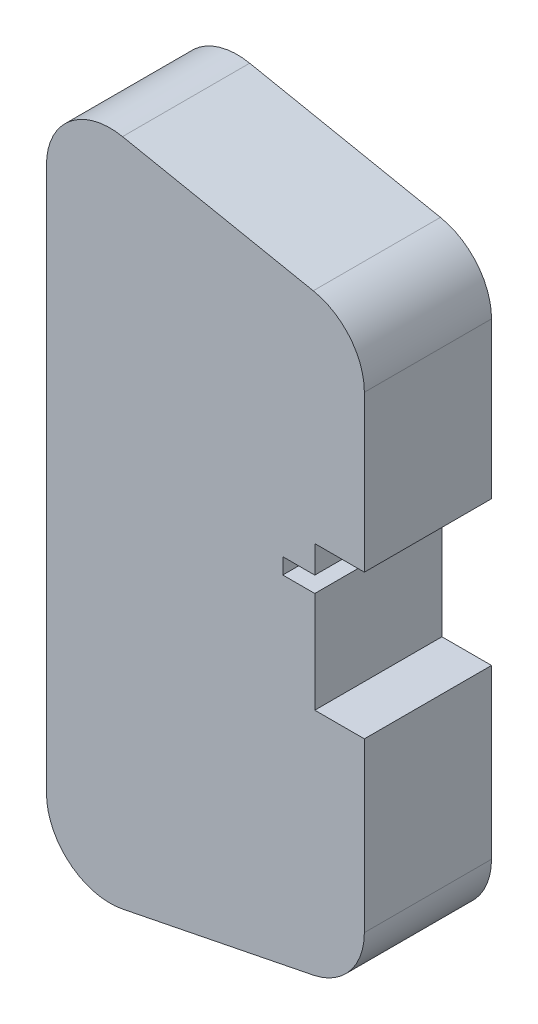
ISO-10303-21;
HEADER;
FILE_DESCRIPTION(('STEP AP214'),'2;1');
FILE_NAME('part.step','',(''),(''),'','','');
FILE_SCHEMA(('AUTOMOTIVE_DESIGN { 1 0 10303 214 1 1 1 1 }'));
ENDSEC;
DATA;
#1=APPLICATION_CONTEXT('core data for automotive mechanical design processes');
#2=APPLICATION_PROTOCOL_DEFINITION('international standard','automotive_design',2000,#1);
#3=PRODUCT_CONTEXT('',#1,'mechanical');
#4=PRODUCT('Part','Part','',(#3));
#5=PRODUCT_RELATED_PRODUCT_CATEGORY('part','',(#4));
#6=PRODUCT_DEFINITION_FORMATION('','',#4);
#7=PRODUCT_DEFINITION_CONTEXT('part definition',#1,'design');
#8=PRODUCT_DEFINITION('design','',#6,#7);
#9=PRODUCT_DEFINITION_SHAPE('','',#8);
#10=(LENGTH_UNIT() NAMED_UNIT(*) SI_UNIT(.MILLI.,.METRE.));
#11=(NAMED_UNIT(*) PLANE_ANGLE_UNIT() SI_UNIT($,.RADIAN.));
#12=(NAMED_UNIT(*) SI_UNIT($,.STERADIAN.) SOLID_ANGLE_UNIT());
#13=UNCERTAINTY_MEASURE_WITH_UNIT(LENGTH_MEASURE(1.E-05),#10,'distance_accuracy_value','');
#14=(GEOMETRIC_REPRESENTATION_CONTEXT(3) GLOBAL_UNCERTAINTY_ASSIGNED_CONTEXT((#13)) GLOBAL_UNIT_ASSIGNED_CONTEXT((#10,
#11,#12)) REPRESENTATION_CONTEXT('',''));
#15=CARTESIAN_POINT('',(0.,0.,0.));
#16=DIRECTION('',(0.,0.,1.));
#17=DIRECTION('',(1.,0.,0.));
#18=AXIS2_PLACEMENT_3D('',#15,#16,#17);
#19=CARTESIAN_POINT('',(50.,-36.8019609728144,20.));
#20=DIRECTION('',(-1.,0.,0.));
#21=DIRECTION('',(0.,0.,1.));
#22=AXIS2_PLACEMENT_3D('',#19,#20,#21);
#23=PLANE('',#22);
#24=DIRECTION('',(0.,1.,0.));
#25=VECTOR('',#24,1.);
#26=CARTESIAN_POINT('',(50.,-36.8019609728144,0.));
#27=LINE('',#26,#25);
#28=CARTESIAN_POINT('',(50.,-36.8019609728144,0.));
#29=VERTEX_POINT('',#28);
#30=CARTESIAN_POINT('',(50.,-10.4028915543573,0.));
#31=VERTEX_POINT('',#30);
#32=EDGE_CURVE('E193',#29,#31,#27,.T.);
#33=ORIENTED_EDGE('',*,*,#32,.T.);
#34=DIRECTION('',(0.,0.,1.));
#35=VECTOR('',#34,1.);
#36=CARTESIAN_POINT('',(50.,-10.4028915543573,0.));
#37=LINE('',#36,#35);
#38=CARTESIAN_POINT('',(50.,-10.4028915543573,20.));
#39=VERTEX_POINT('',#38);
#40=EDGE_CURVE('E242',#31,#39,#37,.T.);
#41=ORIENTED_EDGE('',*,*,#40,.T.);
#42=DIRECTION('',(0.,1.,0.));
#43=VECTOR('',#42,1.);
#44=CARTESIAN_POINT('',(50.,-36.8019609728144,20.));
#45=LINE('',#44,#43);
#46=CARTESIAN_POINT('',(50.,-36.8019609728144,20.));
#47=VERTEX_POINT('',#46);
#48=EDGE_CURVE('E244',#47,#39,#45,.T.);
#49=ORIENTED_EDGE('',*,*,#48,.F.);
#50=DIRECTION('',(0.,0.,-1.));
#51=VECTOR('',#50,1.);
#52=CARTESIAN_POINT('',(50.,-36.8019609728144,20.));
#53=LINE('',#52,#51);
#54=EDGE_CURVE('E224',#47,#29,#53,.T.);
#55=ORIENTED_EDGE('',*,*,#54,.T.);
#56=EDGE_LOOP('',(#33,#41,#49,#55));
#57=FACE_BOUND('',#56,.T.);
#58=ADVANCED_FACE('F32',(#57),#23,.F.);
#59=CARTESIAN_POINT('',(10.,-42.8019609728144,20.));
#60=DIRECTION('',(0.,0.,-1.));
#61=DIRECTION('',(-1.,0.,0.));
#62=AXIS2_PLACEMENT_3D('',#59,#60,#61);
#63=CYLINDRICAL_SURFACE('',#62,10.);
#64=CARTESIAN_POINT('',(10.,-42.8019609728144,0.));
#65=DIRECTION('',(0.,0.,1.));
#66=DIRECTION('',(1.,0.,0.));
#67=AXIS2_PLACEMENT_3D('',#64,#65,#66);
#68=CIRCLE('',#67,10.);
#69=CARTESIAN_POINT('',(0.,-42.8019609728144,0.));
#70=VERTEX_POINT('',#69);
#71=CARTESIAN_POINT('',(11.9611613513819,-52.6077677297236,0.));
#72=VERTEX_POINT('',#71);
#73=EDGE_CURVE('E258',#70,#72,#68,.T.);
#74=ORIENTED_EDGE('',*,*,#73,.T.);
#75=DIRECTION('',(0.,0.,-1.));
#76=VECTOR('',#75,1.);
#77=CARTESIAN_POINT('',(11.9611613513819,-52.6077677297236,20.));
#78=LINE('',#77,#76);
#79=CARTESIAN_POINT('',(11.9611613513819,-52.6077677297236,20.));
#80=VERTEX_POINT('',#79);
#81=EDGE_CURVE('E11',#80,#72,#78,.T.);
#82=ORIENTED_EDGE('',*,*,#81,.F.);
#83=CARTESIAN_POINT('',(10.,-42.8019609728144,20.));
#84=DIRECTION('',(0.,0.,1.));
#85=DIRECTION('',(1.,0.,0.));
#86=AXIS2_PLACEMENT_3D('',#83,#84,#85);
#87=CIRCLE('',#86,10.);
#88=CARTESIAN_POINT('',(0.,-42.8019609728144,20.));
#89=VERTEX_POINT('',#88);
#90=EDGE_CURVE('E208',#89,#80,#87,.T.);
#91=ORIENTED_EDGE('',*,*,#90,.F.);
#92=DIRECTION('',(0.,0.,-1.));
#93=VECTOR('',#92,1.);
#94=CARTESIAN_POINT('',(0.,-42.8019609728144,20.));
#95=LINE('',#94,#93);
#96=EDGE_CURVE('E209',#89,#70,#95,.T.);
#97=ORIENTED_EDGE('',*,*,#96,.T.);
#98=EDGE_LOOP('',(#74,#82,#91,#97));
#99=FACE_BOUND('',#98,.T.);
#100=ADVANCED_FACE('F34',(#99),#63,.T.);
#101=CARTESIAN_POINT('',(41.9611613513819,-46.6077677297236,20.));
#102=DIRECTION('',(-0.196116135138184,0.98058067569092,0.));
#103=DIRECTION('',(-0.98058067569092,-0.196116135138184,0.));
#104=AXIS2_PLACEMENT_3D('',#101,#102,#103);
#105=PLANE('',#104);
#106=DIRECTION('',(0.98058067569092,0.196116135138184,0.));
#107=VECTOR('',#106,1.);
#108=CARTESIAN_POINT('',(41.9611613513819,-46.6077677297236,0.));
#109=LINE('',#108,#107);
#110=CARTESIAN_POINT('',(41.9611613513818,-46.6077677297236,0.));
#111=VERTEX_POINT('',#110);
#112=EDGE_CURVE('E197',#72,#111,#109,.T.);
#113=ORIENTED_EDGE('',*,*,#112,.T.);
#114=DIRECTION('',(0.,0.,-1.));
#115=VECTOR('',#114,1.);
#116=CARTESIAN_POINT('',(41.9611613513818,-46.6077677297236,20.));
#117=LINE('',#116,#115);
#118=CARTESIAN_POINT('',(41.9611613513818,-46.6077677297236,20.));
#119=VERTEX_POINT('',#118);
#120=EDGE_CURVE('E40',#119,#111,#117,.T.);
#121=ORIENTED_EDGE('',*,*,#120,.F.);
#122=DIRECTION('',(0.98058067569092,0.196116135138184,0.));
#123=VECTOR('',#122,1.);
#124=CARTESIAN_POINT('',(41.9611613513819,-46.6077677297236,20.));
#125=LINE('',#124,#123);
#126=EDGE_CURVE('E263',#80,#119,#125,.T.);
#127=ORIENTED_EDGE('',*,*,#126,.F.);
#128=ORIENTED_EDGE('',*,*,#81,.T.);
#129=EDGE_LOOP('',(#113,#121,#127,#128));
#130=FACE_BOUND('',#129,.T.);
#131=ADVANCED_FACE('F261',(#130),#105,.F.);
#132=CARTESIAN_POINT('',(40.,-36.8019609728144,20.));
#133=DIRECTION('',(0.,0.,-1.));
#134=DIRECTION('',(-1.,0.,0.));
#135=AXIS2_PLACEMENT_3D('',#132,#133,#134);
#136=CYLINDRICAL_SURFACE('',#135,10.);
#137=CARTESIAN_POINT('',(40.,-36.8019609728144,0.));
#138=DIRECTION('',(0.,0.,1.));
#139=DIRECTION('',(1.,0.,0.));
#140=AXIS2_PLACEMENT_3D('',#137,#138,#139);
#141=CIRCLE('',#140,10.);
#142=EDGE_CURVE('E194',#111,#29,#141,.T.);
#143=ORIENTED_EDGE('',*,*,#142,.T.);
#144=ORIENTED_EDGE('',*,*,#54,.F.);
#145=CARTESIAN_POINT('',(40.,-36.8019609728144,20.));
#146=DIRECTION('',(0.,0.,1.));
#147=DIRECTION('',(1.,0.,0.));
#148=AXIS2_PLACEMENT_3D('',#145,#146,#147);
#149=CIRCLE('',#148,10.);
#150=EDGE_CURVE('E233',#119,#47,#149,.T.);
#151=ORIENTED_EDGE('',*,*,#150,.F.);
#152=ORIENTED_EDGE('',*,*,#120,.T.);
#153=EDGE_LOOP('',(#143,#144,#151,#152));
#154=FACE_BOUND('',#153,.T.);
#155=ADVANCED_FACE('F231',(#154),#136,.T.);
#156=CARTESIAN_POINT('',(50.,12.2971084456427,20.));
#157=VERTEX_POINT('',#156);
#158=CARTESIAN_POINT('',(50.,36.8019609728144,20.));
#159=VERTEX_POINT('',#158);
#160=EDGE_CURVE('E185',#157,#159,#45,.T.);
#161=ORIENTED_EDGE('',*,*,#160,.F.);
#162=DIRECTION('',(0.,0.,1.));
#163=VECTOR('',#162,1.);
#164=CARTESIAN_POINT('',(50.,12.2971084456427,0.));
#165=LINE('',#164,#163);
#166=CARTESIAN_POINT('',(50.,12.2971084456427,0.));
#167=VERTEX_POINT('',#166);
#168=EDGE_CURVE('E172',#167,#157,#165,.T.);
#169=ORIENTED_EDGE('',*,*,#168,.F.);
#170=CARTESIAN_POINT('',(50.,36.8019609728144,0.));
#171=VERTEX_POINT('',#170);
#172=EDGE_CURVE('E183',#167,#171,#27,.T.);
#173=ORIENTED_EDGE('',*,*,#172,.T.);
#174=DIRECTION('',(0.,0.,-1.));
#175=VECTOR('',#174,1.);
#176=CARTESIAN_POINT('',(50.,36.8019609728144,20.));
#177=LINE('',#176,#175);
#178=EDGE_CURVE('E222',#159,#171,#177,.T.);
#179=ORIENTED_EDGE('',*,*,#178,.F.);
#180=EDGE_LOOP('',(#161,#169,#173,#179));
#181=FACE_BOUND('',#180,.T.);
#182=ADVANCED_FACE('F181',(#181),#23,.F.);
#183=CARTESIAN_POINT('',(40.,36.8019609728144,20.));
#184=DIRECTION('',(0.,0.,-1.));
#185=DIRECTION('',(-1.,0.,0.));
#186=AXIS2_PLACEMENT_3D('',#183,#184,#185);
#187=CYLINDRICAL_SURFACE('',#186,10.);
#188=CARTESIAN_POINT('',(40.,36.8019609728144,0.));
#189=DIRECTION('',(0.,0.,1.));
#190=DIRECTION('',(-1.,0.,0.));
#191=AXIS2_PLACEMENT_3D('',#188,#189,#190);
#192=CIRCLE('',#191,10.);
#193=CARTESIAN_POINT('',(41.9611613513819,46.6077677297236,0.));
#194=VERTEX_POINT('',#193);
#195=EDGE_CURVE('E192',#171,#194,#192,.T.);
#196=ORIENTED_EDGE('',*,*,#195,.T.);
#197=DIRECTION('',(0.,0.,-1.));
#198=VECTOR('',#197,1.);
#199=CARTESIAN_POINT('',(41.9611613513819,46.6077677297236,20.));
#200=LINE('',#199,#198);
#201=CARTESIAN_POINT('',(41.9611613513819,46.6077677297236,20.));
#202=VERTEX_POINT('',#201);
#203=EDGE_CURVE('E219',#202,#194,#200,.T.);
#204=ORIENTED_EDGE('',*,*,#203,.F.);
#205=CARTESIAN_POINT('',(40.,36.8019609728144,20.));
#206=DIRECTION('',(0.,0.,1.));
#207=DIRECTION('',(-1.,0.,0.));
#208=AXIS2_PLACEMENT_3D('',#205,#206,#207);
#209=CIRCLE('',#208,10.);
#210=EDGE_CURVE('E247',#159,#202,#209,.T.);
#211=ORIENTED_EDGE('',*,*,#210,.F.);
#212=ORIENTED_EDGE('',*,*,#178,.T.);
#213=EDGE_LOOP('',(#196,#204,#211,#212));
#214=FACE_BOUND('',#213,.T.);
#215=ADVANCED_FACE('F284',(#214),#187,.T.);
#216=CARTESIAN_POINT('',(11.9611613513819,52.6077677297236,20.));
#217=DIRECTION('',(-0.196116135138184,-0.98058067569092,0.));
#218=DIRECTION('',(0.98058067569092,-0.196116135138184,0.));
#219=AXIS2_PLACEMENT_3D('',#216,#217,#218);
#220=PLANE('',#219);
#221=DIRECTION('',(-0.98058067569092,0.196116135138184,0.));
#222=VECTOR('',#221,1.);
#223=CARTESIAN_POINT('',(11.9611613513819,52.6077677297236,0.));
#224=LINE('',#223,#222);
#225=CARTESIAN_POINT('',(11.9611613513819,52.6077677297236,0.));
#226=VERTEX_POINT('',#225);
#227=EDGE_CURVE('E202',#194,#226,#224,.T.);
#228=ORIENTED_EDGE('',*,*,#227,.T.);
#229=DIRECTION('',(0.,0.,-1.));
#230=VECTOR('',#229,1.);
#231=CARTESIAN_POINT('',(11.9611613513819,52.6077677297236,20.));
#232=LINE('',#231,#230);
#233=CARTESIAN_POINT('',(11.9611613513819,52.6077677297236,20.));
#234=VERTEX_POINT('',#233);
#235=EDGE_CURVE('E216',#234,#226,#232,.T.);
#236=ORIENTED_EDGE('',*,*,#235,.F.);
#237=DIRECTION('',(-0.98058067569092,0.196116135138184,0.));
#238=VECTOR('',#237,1.);
#239=CARTESIAN_POINT('',(11.9611613513819,52.6077677297236,20.));
#240=LINE('',#239,#238);
#241=EDGE_CURVE('E249',#202,#234,#240,.T.);
#242=ORIENTED_EDGE('',*,*,#241,.F.);
#243=ORIENTED_EDGE('',*,*,#203,.T.);
#244=EDGE_LOOP('',(#228,#236,#242,#243));
#245=FACE_BOUND('',#244,.T.);
#246=ADVANCED_FACE('F280',(#245),#220,.F.);
#247=CARTESIAN_POINT('',(10.,42.8019609728144,20.));
#248=DIRECTION('',(0.,0.,-1.));
#249=DIRECTION('',(-1.,0.,0.));
#250=AXIS2_PLACEMENT_3D('',#247,#248,#249);
#251=CYLINDRICAL_SURFACE('',#250,10.);
#252=CARTESIAN_POINT('',(10.,42.8019609728144,0.));
#253=DIRECTION('',(0.,0.,1.));
#254=DIRECTION('',(-1.,0.,0.));
#255=AXIS2_PLACEMENT_3D('',#252,#253,#254);
#256=CIRCLE('',#255,10.);
#257=CARTESIAN_POINT('',(0.,42.8019609728144,0.));
#258=VERTEX_POINT('',#257);
#259=EDGE_CURVE('E204',#226,#258,#256,.T.);
#260=ORIENTED_EDGE('',*,*,#259,.T.);
#261=DIRECTION('',(0.,0.,-1.));
#262=VECTOR('',#261,1.);
#263=CARTESIAN_POINT('',(0.,42.8019609728144,20.));
#264=LINE('',#263,#262);
#265=CARTESIAN_POINT('',(0.,42.8019609728144,20.));
#266=VERTEX_POINT('',#265);
#267=EDGE_CURVE('E212',#266,#258,#264,.T.);
#268=ORIENTED_EDGE('',*,*,#267,.F.);
#269=CARTESIAN_POINT('',(10.,42.8019609728144,20.));
#270=DIRECTION('',(0.,0.,1.));
#271=DIRECTION('',(-1.,0.,0.));
#272=AXIS2_PLACEMENT_3D('',#269,#270,#271);
#273=CIRCLE('',#272,10.);
#274=EDGE_CURVE('E255',#234,#266,#273,.T.);
#275=ORIENTED_EDGE('',*,*,#274,.F.);
#276=ORIENTED_EDGE('',*,*,#235,.T.);
#277=EDGE_LOOP('',(#260,#268,#275,#276));
#278=FACE_BOUND('',#277,.T.);
#279=ADVANCED_FACE('F276',(#278),#251,.T.);
#280=CARTESIAN_POINT('',(0.,42.8019609728144,20.));
#281=DIRECTION('',(1.,0.,0.));
#282=DIRECTION('',(0.,0.,-1.));
#283=AXIS2_PLACEMENT_3D('',#280,#281,#282);
#284=PLANE('',#283);
#285=DIRECTION('',(0.,0.,1.));
#286=VECTOR('',#285,1.);
#287=CARTESIAN_POINT('',(0.,15.842836282418,5.49999999999999));
#288=LINE('',#287,#286);
#289=CARTESIAN_POINT('',(0.,15.842836282418,5.49999999999999));
#290=VERTEX_POINT('',#289);
#291=CARTESIAN_POINT('',(0.,15.842836282418,14.5));
#292=VERTEX_POINT('',#291);
#293=EDGE_CURVE('E346',#290,#292,#288,.T.);
#294=ORIENTED_EDGE('',*,*,#293,.F.);
#295=DIRECTION('',(0.,-1.,0.));
#296=VECTOR('',#295,1.);
#297=CARTESIAN_POINT('',(0.,15.842836282418,5.49999999999999));
#298=LINE('',#297,#296);
#299=CARTESIAN_POINT('',(0.,17.2971084456427,5.49999999999999));
#300=VERTEX_POINT('',#299);
#301=EDGE_CURVE('E55',#300,#290,#298,.T.);
#302=ORIENTED_EDGE('',*,*,#301,.F.);
#303=DIRECTION('',(0.,0.,-1.));
#304=VECTOR('',#303,1.);
#305=CARTESIAN_POINT('',(0.,17.2971084456427,5.49999999999999));
#306=LINE('',#305,#304);
#307=CARTESIAN_POINT('',(0.,17.2971084456427,14.5));
#308=VERTEX_POINT('',#307);
#309=EDGE_CURVE('E335',#308,#300,#306,.T.);
#310=ORIENTED_EDGE('',*,*,#309,.F.);
#311=DIRECTION('',(0.,1.,0.));
#312=VECTOR('',#311,1.);
#313=CARTESIAN_POINT('',(0.,17.2971084456427,14.5));
#314=LINE('',#313,#312);
#315=EDGE_CURVE('E349',#292,#308,#314,.T.);
#316=ORIENTED_EDGE('',*,*,#315,.F.);
#317=EDGE_LOOP('',(#294,#302,#310,#316));
#318=FACE_BOUND('',#317,.T.);
#319=DIRECTION('',(0.,-1.,0.));
#320=VECTOR('',#319,1.);
#321=CARTESIAN_POINT('',(0.,42.8019609728144,0.));
#322=LINE('',#321,#320);
#323=EDGE_CURVE('E206',#258,#70,#322,.T.);
#324=ORIENTED_EDGE('',*,*,#323,.T.);
#325=ORIENTED_EDGE('',*,*,#96,.F.);
#326=DIRECTION('',(0.,-1.,0.));
#327=VECTOR('',#326,1.);
#328=CARTESIAN_POINT('',(0.,42.8019609728144,20.));
#329=LINE('',#328,#327);
#330=EDGE_CURVE('E213',#266,#89,#329,.T.);
#331=ORIENTED_EDGE('',*,*,#330,.F.);
#332=ORIENTED_EDGE('',*,*,#267,.T.);
#333=EDGE_LOOP('',(#324,#325,#331,#332));
#334=FACE_BOUND('',#333,.T.);
#335=ADVANCED_FACE('F271',(#318,#334),#284,.F.);
#336=CARTESIAN_POINT('',(10.,-42.8019609728144,20.));
#337=DIRECTION('',(0.,0.,1.));
#338=DIRECTION('',(1.,0.,0.));
#339=AXIS2_PLACEMENT_3D('',#336,#337,#338);
#340=PLANE('',#339);
#341=DIRECTION('',(1.,0.,0.));
#342=VECTOR('',#341,1.);
#343=CARTESIAN_POINT('',(42.2,-10.4028915543573,20.));
#344=LINE('',#343,#342);
#345=CARTESIAN_POINT('',(42.2,-10.4028915543573,20.));
#346=VERTEX_POINT('',#345);
#347=EDGE_CURVE('E177',#346,#39,#344,.T.);
#348=ORIENTED_EDGE('',*,*,#347,.F.);
#349=DIRECTION('',(0.,-1.,0.));
#350=VECTOR('',#349,1.);
#351=CARTESIAN_POINT('',(42.2,5.49710844564269,20.));
#352=LINE('',#351,#350);
#353=CARTESIAN_POINT('',(42.2,5.49710844564269,20.));
#354=VERTEX_POINT('',#353);
#355=EDGE_CURVE('E309',#354,#346,#352,.T.);
#356=ORIENTED_EDGE('',*,*,#355,.F.);
#357=DIRECTION('',(1.,0.,0.));
#358=VECTOR('',#357,1.);
#359=CARTESIAN_POINT('',(42.2,5.49710844564269,20.));
#360=LINE('',#359,#358);
#361=CARTESIAN_POINT('',(37.17,5.49710844564268,20.));
#362=VERTEX_POINT('',#361);
#363=EDGE_CURVE('E306',#362,#354,#360,.T.);
#364=ORIENTED_EDGE('',*,*,#363,.F.);
#365=DIRECTION('',(0.,-1.,0.));
#366=VECTOR('',#365,1.);
#367=CARTESIAN_POINT('',(37.17,5.49710844564268,20.));
#368=LINE('',#367,#366);
#369=CARTESIAN_POINT('',(37.17,7.99710844564268,20.));
#370=VERTEX_POINT('',#369);
#371=EDGE_CURVE('E303',#370,#362,#368,.T.);
#372=ORIENTED_EDGE('',*,*,#371,.F.);
#373=DIRECTION('',(-1.,0.,0.));
#374=VECTOR('',#373,1.);
#375=CARTESIAN_POINT('',(37.17,7.99710844564268,20.));
#376=LINE('',#375,#374);
#377=CARTESIAN_POINT('',(42.2,7.99710844564268,20.));
#378=VERTEX_POINT('',#377);
#379=EDGE_CURVE('E293',#378,#370,#376,.T.);
#380=ORIENTED_EDGE('',*,*,#379,.F.);
#381=DIRECTION('',(0.,-1.,0.));
#382=VECTOR('',#381,1.);
#383=CARTESIAN_POINT('',(42.2,7.99710844564268,20.));
#384=LINE('',#383,#382);
#385=CARTESIAN_POINT('',(42.2,12.2971084456427,20.));
#386=VERTEX_POINT('',#385);
#387=EDGE_CURVE('E290',#386,#378,#384,.T.);
#388=ORIENTED_EDGE('',*,*,#387,.F.);
#389=DIRECTION('',(-1.,0.,0.));
#390=VECTOR('',#389,1.);
#391=CARTESIAN_POINT('',(42.2,12.2971084456427,20.));
#392=LINE('',#391,#390);
#393=EDGE_CURVE('E287',#157,#386,#392,.T.);
#394=ORIENTED_EDGE('',*,*,#393,.F.);
#395=ORIENTED_EDGE('',*,*,#160,.T.);
#396=ORIENTED_EDGE('',*,*,#210,.T.);
#397=ORIENTED_EDGE('',*,*,#241,.T.);
#398=ORIENTED_EDGE('',*,*,#274,.T.);
#399=ORIENTED_EDGE('',*,*,#330,.T.);
#400=ORIENTED_EDGE('',*,*,#90,.T.);
#401=ORIENTED_EDGE('',*,*,#126,.T.);
#402=ORIENTED_EDGE('',*,*,#150,.T.);
#403=ORIENTED_EDGE('',*,*,#48,.T.);
#404=EDGE_LOOP('',(#348,#356,#364,#372,#380,#388,#394,#395,#396,#397,#398,#399,#400,#401,#402,#403));
#405=FACE_BOUND('',#404,.T.);
#406=ADVANCED_FACE('F285',(#405),#340,.T.);
#407=CARTESIAN_POINT('',(10.,-42.8019609728144,0.));
#408=DIRECTION('',(0.,0.,1.));
#409=DIRECTION('',(1.,0.,0.));
#410=AXIS2_PLACEMENT_3D('',#407,#408,#409);
#411=PLANE('',#410);
#412=DIRECTION('',(0.,-1.,0.));
#413=VECTOR('',#412,1.);
#414=CARTESIAN_POINT('',(42.2,5.49710844564269,0.));
#415=LINE('',#414,#413);
#416=CARTESIAN_POINT('',(42.2,5.49710844564269,0.));
#417=VERTEX_POINT('',#416);
#418=CARTESIAN_POINT('',(42.2,-10.4028915543573,0.));
#419=VERTEX_POINT('',#418);
#420=EDGE_CURVE('E619',#417,#419,#415,.T.);
#421=ORIENTED_EDGE('',*,*,#420,.T.);
#422=DIRECTION('',(1.,0.,0.));
#423=VECTOR('',#422,1.);
#424=CARTESIAN_POINT('',(42.2,-10.4028915543573,0.));
#425=LINE('',#424,#423);
#426=EDGE_CURVE('E186',#419,#31,#425,.T.);
#427=ORIENTED_EDGE('',*,*,#426,.T.);
#428=ORIENTED_EDGE('',*,*,#32,.F.);
#429=ORIENTED_EDGE('',*,*,#142,.F.);
#430=ORIENTED_EDGE('',*,*,#112,.F.);
#431=ORIENTED_EDGE('',*,*,#73,.F.);
#432=ORIENTED_EDGE('',*,*,#323,.F.);
#433=ORIENTED_EDGE('',*,*,#259,.F.);
#434=ORIENTED_EDGE('',*,*,#227,.F.);
#435=ORIENTED_EDGE('',*,*,#195,.F.);
#436=ORIENTED_EDGE('',*,*,#172,.F.);
#437=DIRECTION('',(-1.,0.,0.));
#438=VECTOR('',#437,1.);
#439=CARTESIAN_POINT('',(42.2,12.2971084456427,0.));
#440=LINE('',#439,#438);
#441=CARTESIAN_POINT('',(42.2,12.2971084456427,0.));
#442=VERTEX_POINT('',#441);
#443=EDGE_CURVE('E168',#167,#442,#440,.T.);
#444=ORIENTED_EDGE('',*,*,#443,.T.);
#445=DIRECTION('',(0.,-1.,0.));
#446=VECTOR('',#445,1.);
#447=CARTESIAN_POINT('',(42.2,7.99710844564268,0.));
#448=LINE('',#447,#446);
#449=CARTESIAN_POINT('',(42.2,7.99710844564268,0.));
#450=VERTEX_POINT('',#449);
#451=EDGE_CURVE('E47',#442,#450,#448,.T.);
#452=ORIENTED_EDGE('',*,*,#451,.T.);
#453=DIRECTION('',(-1.,0.,0.));
#454=VECTOR('',#453,1.);
#455=CARTESIAN_POINT('',(37.17,7.99710844564268,0.));
#456=LINE('',#455,#454);
#457=CARTESIAN_POINT('',(37.17,7.99710844564268,0.));
#458=VERTEX_POINT('',#457);
#459=EDGE_CURVE('E611',#450,#458,#456,.T.);
#460=ORIENTED_EDGE('',*,*,#459,.T.);
#461=DIRECTION('',(0.,-1.,0.));
#462=VECTOR('',#461,1.);
#463=CARTESIAN_POINT('',(37.17,5.49710844564268,0.));
#464=LINE('',#463,#462);
#465=CARTESIAN_POINT('',(37.17,5.49710844564268,0.));
#466=VERTEX_POINT('',#465);
#467=EDGE_CURVE('E614',#458,#466,#464,.T.);
#468=ORIENTED_EDGE('',*,*,#467,.T.);
#469=DIRECTION('',(1.,0.,0.));
#470=VECTOR('',#469,1.);
#471=CARTESIAN_POINT('',(42.2,5.49710844564269,0.));
#472=LINE('',#471,#470);
#473=EDGE_CURVE('E617',#466,#417,#472,.T.);
#474=ORIENTED_EDGE('',*,*,#473,.T.);
#475=EDGE_LOOP('',(#421,#427,#428,#429,#430,#431,#432,#433,#434,#435,#436,#444,#452,#460,#468,#474));
#476=FACE_BOUND('',#475,.T.);
#477=ADVANCED_FACE('F190',(#476),#411,.F.);
#478=CARTESIAN_POINT('',(10.,15.842836282418,5.49999999999999));
#479=DIRECTION('',(0.,0.,-1.));
#480=DIRECTION('',(-1.,0.,0.));
#481=AXIS2_PLACEMENT_3D('',#478,#479,#480);
#482=PLANE('',#481);
#483=ORIENTED_EDGE('',*,*,#301,.T.);
#484=DIRECTION('',(-1.,0.,0.));
#485=VECTOR('',#484,1.);
#486=CARTESIAN_POINT('',(10.,15.842836282418,5.49999999999999));
#487=LINE('',#486,#485);
#488=CARTESIAN_POINT('',(10.,15.842836282418,5.49999999999999));
#489=VERTEX_POINT('',#488);
#490=EDGE_CURVE('E344',#489,#290,#487,.T.);
#491=ORIENTED_EDGE('',*,*,#490,.F.);
#492=DIRECTION('',(0.,-1.,0.));
#493=VECTOR('',#492,1.);
#494=CARTESIAN_POINT('',(10.,15.842836282418,5.49999999999999));
#495=LINE('',#494,#493);
#496=CARTESIAN_POINT('',(10.,17.2971084456427,5.49999999999999));
#497=VERTEX_POINT('',#496);
#498=EDGE_CURVE('E331',#497,#489,#495,.T.);
#499=ORIENTED_EDGE('',*,*,#498,.F.);
#500=DIRECTION('',(-1.,0.,0.));
#501=VECTOR('',#500,1.);
#502=CARTESIAN_POINT('',(10.,17.2971084456427,5.49999999999999));
#503=LINE('',#502,#501);
#504=EDGE_CURVE('E260',#497,#300,#503,.T.);
#505=ORIENTED_EDGE('',*,*,#504,.T.);
#506=EDGE_LOOP('',(#483,#491,#499,#505));
#507=FACE_BOUND('',#506,.T.);
#508=ADVANCED_FACE('F374',(#507),#482,.F.);
#509=CARTESIAN_POINT('',(10.,17.2971084456427,5.49999999999999));
#510=DIRECTION('',(0.,1.,0.));
#511=DIRECTION('',(0.,0.,1.));
#512=AXIS2_PLACEMENT_3D('',#509,#510,#511);
#513=PLANE('',#512);
#514=CARTESIAN_POINT('',(2.64487157528492,17.2971084456427,9.99999999999999));
#515=DIRECTION('',(0.,-1.,0.));
#516=DIRECTION('',(0.,0.,-1.));
#517=AXIS2_PLACEMENT_3D('',#514,#515,#516);
#518=CIRCLE('',#517,0.5);
#519=CARTESIAN_POINT('',(2.64487157528492,17.2971084456427,9.49999999999999));
#520=VERTEX_POINT('',#519);
#521=EDGE_CURVE('E314',#520,#520,#518,.T.);
#522=ORIENTED_EDGE('',*,*,#521,.F.);
#523=EDGE_LOOP('',(#522));
#524=FACE_BOUND('',#523,.T.);
#525=ORIENTED_EDGE('',*,*,#309,.T.);
#526=ORIENTED_EDGE('',*,*,#504,.F.);
#527=DIRECTION('',(0.,0.,-1.));
#528=VECTOR('',#527,1.);
#529=CARTESIAN_POINT('',(10.,17.2971084456427,5.49999999999999));
#530=LINE('',#529,#528);
#531=CARTESIAN_POINT('',(10.,17.2971084456427,14.5));
#532=VERTEX_POINT('',#531);
#533=EDGE_CURVE('E341',#532,#497,#530,.T.);
#534=ORIENTED_EDGE('',*,*,#533,.F.);
#535=DIRECTION('',(-1.,0.,0.));
#536=VECTOR('',#535,1.);
#537=CARTESIAN_POINT('',(10.,17.2971084456427,14.5));
#538=LINE('',#537,#536);
#539=EDGE_CURVE('E355',#532,#308,#538,.T.);
#540=ORIENTED_EDGE('',*,*,#539,.T.);
#541=EDGE_LOOP('',(#525,#526,#534,#540));
#542=FACE_BOUND('',#541,.T.);
#543=ADVANCED_FACE('F376',(#524,#542),#513,.F.);
#544=CARTESIAN_POINT('',(10.,17.2971084456427,14.5));
#545=DIRECTION('',(0.,0.,1.));
#546=DIRECTION('',(1.,0.,0.));
#547=AXIS2_PLACEMENT_3D('',#544,#545,#546);
#548=PLANE('',#547);
#549=ORIENTED_EDGE('',*,*,#315,.T.);
#550=ORIENTED_EDGE('',*,*,#539,.F.);
#551=DIRECTION('',(0.,1.,0.));
#552=VECTOR('',#551,1.);
#553=CARTESIAN_POINT('',(10.,17.2971084456427,14.5));
#554=LINE('',#553,#552);
#555=CARTESIAN_POINT('',(10.,15.842836282418,14.5));
#556=VERTEX_POINT('',#555);
#557=EDGE_CURVE('E338',#556,#532,#554,.T.);
#558=ORIENTED_EDGE('',*,*,#557,.F.);
#559=DIRECTION('',(-1.,0.,0.));
#560=VECTOR('',#559,1.);
#561=CARTESIAN_POINT('',(10.,15.842836282418,14.5));
#562=LINE('',#561,#560);
#563=EDGE_CURVE('E357',#556,#292,#562,.T.);
#564=ORIENTED_EDGE('',*,*,#563,.T.);
#565=EDGE_LOOP('',(#549,#550,#558,#564));
#566=FACE_BOUND('',#565,.T.);
#567=ADVANCED_FACE('F369',(#566),#548,.F.);
#568=CARTESIAN_POINT('',(10.,15.842836282418,5.49999999999999));
#569=DIRECTION('',(0.,-1.,0.));
#570=DIRECTION('',(0.,0.,-1.));
#571=AXIS2_PLACEMENT_3D('',#568,#569,#570);
#572=PLANE('',#571);
#573=ORIENTED_EDGE('',*,*,#293,.T.);
#574=ORIENTED_EDGE('',*,*,#563,.F.);
#575=DIRECTION('',(0.,0.,1.));
#576=VECTOR('',#575,1.);
#577=CARTESIAN_POINT('',(10.,15.842836282418,5.49999999999999));
#578=LINE('',#577,#576);
#579=EDGE_CURVE('E334',#489,#556,#578,.T.);
#580=ORIENTED_EDGE('',*,*,#579,.F.);
#581=ORIENTED_EDGE('',*,*,#490,.T.);
#582=EDGE_LOOP('',(#573,#574,#580,#581));
#583=FACE_BOUND('',#582,.T.);
#584=ADVANCED_FACE('F363',(#583),#572,.F.);
#585=CARTESIAN_POINT('',(10.,0.,0.));
#586=DIRECTION('',(1.,0.,0.));
#587=DIRECTION('',(0.,0.,-1.));
#588=AXIS2_PLACEMENT_3D('',#585,#586,#587);
#589=PLANE('',#588);
#590=ORIENTED_EDGE('',*,*,#498,.T.);
#591=ORIENTED_EDGE('',*,*,#579,.T.);
#592=ORIENTED_EDGE('',*,*,#557,.T.);
#593=ORIENTED_EDGE('',*,*,#533,.T.);
#594=EDGE_LOOP('',(#590,#591,#592,#593));
#595=FACE_BOUND('',#594,.T.);
#596=ADVANCED_FACE('F373',(#595),#589,.F.);
#597=CARTESIAN_POINT('',(2.64487157528492,22.2971084456427,9.99999999999999));
#598=DIRECTION('',(0.,-1.,0.));
#599=DIRECTION('',(0.,0.,-1.));
#600=AXIS2_PLACEMENT_3D('',#597,#598,#599);
#601=CYLINDRICAL_SURFACE('',#600,0.5);
#602=CARTESIAN_POINT('',(2.64487157528492,22.2971084456427,9.99999999999999));
#603=DIRECTION('',(0.,-1.,0.));
#604=DIRECTION('',(0.,0.,-1.));
#605=AXIS2_PLACEMENT_3D('',#602,#603,#604);
#606=CIRCLE('',#605,0.5);
#607=CARTESIAN_POINT('',(2.64487157528492,22.2971084456427,9.49999999999999));
#608=VERTEX_POINT('',#607);
#609=EDGE_CURVE('E326',#608,#608,#606,.T.);
#610=ORIENTED_EDGE('',*,*,#609,.F.);
#611=EDGE_LOOP('',(#610));
#612=FACE_BOUND('',#611,.T.);
#613=ORIENTED_EDGE('',*,*,#521,.T.);
#614=EDGE_LOOP('',(#613));
#615=FACE_BOUND('',#614,.T.);
#616=ADVANCED_FACE('F492',(#612,#615),#601,.F.);
#617=CARTESIAN_POINT('',(2.64487157528492,22.2971084456427,9.99999999999999));
#618=DIRECTION('',(0.,-1.,0.));
#619=DIRECTION('',(0.,0.,-1.));
#620=AXIS2_PLACEMENT_3D('',#617,#618,#619);
#621=PLANE('',#620);
#622=ORIENTED_EDGE('',*,*,#609,.T.);
#623=EDGE_LOOP('',(#622));
#624=FACE_BOUND('',#623,.T.);
#625=ADVANCED_FACE('F498',(#624),#621,.T.);
#626=CARTESIAN_POINT('',(42.2,-10.4028915543573,0.));
#627=DIRECTION('',(0.,-1.,0.));
#628=DIRECTION('',(1.,0.,0.));
#629=AXIS2_PLACEMENT_3D('',#626,#627,#628);
#630=PLANE('',#629);
#631=ORIENTED_EDGE('',*,*,#347,.T.);
#632=ORIENTED_EDGE('',*,*,#40,.F.);
#633=ORIENTED_EDGE('',*,*,#426,.F.);
#634=DIRECTION('',(0.,0.,1.));
#635=VECTOR('',#634,1.);
#636=CARTESIAN_POINT('',(42.2,-10.4028915543573,0.));
#637=LINE('',#636,#635);
#638=EDGE_CURVE('E315',#419,#346,#637,.T.);
#639=ORIENTED_EDGE('',*,*,#638,.T.);
#640=EDGE_LOOP('',(#631,#632,#633,#639));
#641=FACE_BOUND('',#640,.T.);
#642=ADVANCED_FACE('F507',(#641),#630,.F.);
#643=CARTESIAN_POINT('',(42.2,5.49710844564269,0.));
#644=DIRECTION('',(-1.,0.,0.));
#645=DIRECTION('',(0.,0.,1.));
#646=AXIS2_PLACEMENT_3D('',#643,#644,#645);
#647=PLANE('',#646);
#648=ORIENTED_EDGE('',*,*,#355,.T.);
#649=ORIENTED_EDGE('',*,*,#638,.F.);
#650=ORIENTED_EDGE('',*,*,#420,.F.);
#651=DIRECTION('',(0.,0.,1.));
#652=VECTOR('',#651,1.);
#653=CARTESIAN_POINT('',(42.2,5.49710844564269,0.));
#654=LINE('',#653,#652);
#655=EDGE_CURVE('E317',#417,#354,#654,.T.);
#656=ORIENTED_EDGE('',*,*,#655,.T.);
#657=EDGE_LOOP('',(#648,#649,#650,#656));
#658=FACE_BOUND('',#657,.T.);
#659=ADVANCED_FACE('F519',(#658),#647,.F.);
#660=CARTESIAN_POINT('',(42.2,5.49710844564269,0.));
#661=DIRECTION('',(0.,-1.,0.));
#662=DIRECTION('',(1.,0.,0.));
#663=AXIS2_PLACEMENT_3D('',#660,#661,#662);
#664=PLANE('',#663);
#665=ORIENTED_EDGE('',*,*,#363,.T.);
#666=ORIENTED_EDGE('',*,*,#655,.F.);
#667=ORIENTED_EDGE('',*,*,#473,.F.);
#668=DIRECTION('',(0.,0.,1.));
#669=VECTOR('',#668,1.);
#670=CARTESIAN_POINT('',(37.17,5.49710844564268,0.));
#671=LINE('',#670,#669);
#672=EDGE_CURVE('E319',#466,#362,#671,.T.);
#673=ORIENTED_EDGE('',*,*,#672,.T.);
#674=EDGE_LOOP('',(#665,#666,#667,#673));
#675=FACE_BOUND('',#674,.T.);
#676=ADVANCED_FACE('F528',(#675),#664,.F.);
#677=CARTESIAN_POINT('',(37.17,5.49710844564268,0.));
#678=DIRECTION('',(-1.,0.,0.));
#679=DIRECTION('',(0.,0.,1.));
#680=AXIS2_PLACEMENT_3D('',#677,#678,#679);
#681=PLANE('',#680);
#682=ORIENTED_EDGE('',*,*,#371,.T.);
#683=ORIENTED_EDGE('',*,*,#672,.F.);
#684=ORIENTED_EDGE('',*,*,#467,.F.);
#685=DIRECTION('',(0.,0.,1.));
#686=VECTOR('',#685,1.);
#687=CARTESIAN_POINT('',(37.17,7.99710844564268,0.));
#688=LINE('',#687,#686);
#689=EDGE_CURVE('E321',#458,#370,#688,.T.);
#690=ORIENTED_EDGE('',*,*,#689,.T.);
#691=EDGE_LOOP('',(#682,#683,#684,#690));
#692=FACE_BOUND('',#691,.T.);
#693=ADVANCED_FACE('F537',(#692),#681,.F.);
#694=CARTESIAN_POINT('',(37.17,7.99710844564268,0.));
#695=DIRECTION('',(0.,1.,0.));
#696=DIRECTION('',(0.,0.,1.));
#697=AXIS2_PLACEMENT_3D('',#694,#695,#696);
#698=PLANE('',#697);
#699=CARTESIAN_POINT('',(39.9,7.99710844564268,10.));
#700=DIRECTION('',(0.,-1.,0.));
#701=DIRECTION('',(0.,0.,-1.));
#702=AXIS2_PLACEMENT_3D('',#699,#700,#701);
#703=CIRCLE('',#702,0.999999999999998);
#704=CARTESIAN_POINT('',(39.9,7.99710844564268,9.));
#705=VERTEX_POINT('',#704);
#706=EDGE_CURVE('E296',#705,#705,#703,.T.);
#707=ORIENTED_EDGE('',*,*,#706,.F.);
#708=EDGE_LOOP('',(#707));
#709=FACE_BOUND('',#708,.T.);
#710=ORIENTED_EDGE('',*,*,#379,.T.);
#711=ORIENTED_EDGE('',*,*,#689,.F.);
#712=ORIENTED_EDGE('',*,*,#459,.F.);
#713=DIRECTION('',(0.,0.,1.));
#714=VECTOR('',#713,1.);
#715=CARTESIAN_POINT('',(42.2,7.99710844564268,0.));
#716=LINE('',#715,#714);
#717=EDGE_CURVE('E323',#450,#378,#716,.T.);
#718=ORIENTED_EDGE('',*,*,#717,.T.);
#719=EDGE_LOOP('',(#710,#711,#712,#718));
#720=FACE_BOUND('',#719,.T.);
#721=ADVANCED_FACE('F546',(#709,#720),#698,.F.);
#722=CARTESIAN_POINT('',(42.2,7.99710844564268,0.));
#723=DIRECTION('',(-1.,0.,0.));
#724=DIRECTION('',(0.,0.,1.));
#725=AXIS2_PLACEMENT_3D('',#722,#723,#724);
#726=PLANE('',#725);
#727=ORIENTED_EDGE('',*,*,#387,.T.);
#728=ORIENTED_EDGE('',*,*,#717,.F.);
#729=ORIENTED_EDGE('',*,*,#451,.F.);
#730=DIRECTION('',(0.,0.,1.));
#731=VECTOR('',#730,1.);
#732=CARTESIAN_POINT('',(42.2,12.2971084456427,0.));
#733=LINE('',#732,#731);
#734=EDGE_CURVE('E174',#442,#386,#733,.T.);
#735=ORIENTED_EDGE('',*,*,#734,.T.);
#736=EDGE_LOOP('',(#727,#728,#729,#735));
#737=FACE_BOUND('',#736,.T.);
#738=ADVANCED_FACE('F556',(#737),#726,.F.);
#739=CARTESIAN_POINT('',(42.2,12.2971084456427,0.));
#740=DIRECTION('',(0.,1.,0.));
#741=DIRECTION('',(0.,0.,1.));
#742=AXIS2_PLACEMENT_3D('',#739,#740,#741);
#743=PLANE('',#742);
#744=ORIENTED_EDGE('',*,*,#393,.T.);
#745=ORIENTED_EDGE('',*,*,#734,.F.);
#746=ORIENTED_EDGE('',*,*,#443,.F.);
#747=ORIENTED_EDGE('',*,*,#168,.T.);
#748=EDGE_LOOP('',(#744,#745,#746,#747));
#749=FACE_BOUND('',#748,.T.);
#750=ADVANCED_FACE('F171',(#749),#743,.F.);
#751=CARTESIAN_POINT('',(39.9,12.9971084456427,10.));
#752=DIRECTION('',(0.,-1.,0.));
#753=DIRECTION('',(0.,0.,-1.));
#754=AXIS2_PLACEMENT_3D('',#751,#752,#753);
#755=CYLINDRICAL_SURFACE('',#754,0.999999999999998);
#756=CARTESIAN_POINT('',(39.9,12.9971084456427,10.));
#757=DIRECTION('',(0.,-1.,0.));
#758=DIRECTION('',(0.,0.,-1.));
#759=AXIS2_PLACEMENT_3D('',#756,#757,#758);
#760=CIRCLE('',#759,0.999999999999998);
#761=CARTESIAN_POINT('',(39.9,12.9971084456427,9.));
#762=VERTEX_POINT('',#761);
#763=EDGE_CURVE('E291',#762,#762,#760,.T.);
#764=ORIENTED_EDGE('',*,*,#763,.F.);
#765=EDGE_LOOP('',(#764));
#766=FACE_BOUND('',#765,.T.);
#767=ORIENTED_EDGE('',*,*,#706,.T.);
#768=EDGE_LOOP('',(#767));
#769=FACE_BOUND('',#768,.T.);
#770=ADVANCED_FACE('F572',(#766,#769),#755,.F.);
#771=CARTESIAN_POINT('',(39.9,12.9971084456427,10.));
#772=DIRECTION('',(0.,-1.,0.));
#773=DIRECTION('',(0.,0.,-1.));
#774=AXIS2_PLACEMENT_3D('',#771,#772,#773);
#775=PLANE('',#774);
#776=ORIENTED_EDGE('',*,*,#763,.T.);
#777=EDGE_LOOP('',(#776));
#778=FACE_BOUND('',#777,.T.);
#779=ADVANCED_FACE('F579',(#778),#775,.T.);
#780=CLOSED_SHELL('',(#58,#100,#131,#155,#182,#215,#246,#279,#335,#406,#477,#508,#543,#567,#584,
#596,#616,#625,#642,#659,#676,#693,#721,#738,#750,#770,#779));
#781=MANIFOLD_SOLID_BREP('B2',#780);
#782=ADVANCED_BREP_SHAPE_REPRESENTATION('',(#18,#781),#14);
#783=SHAPE_DEFINITION_REPRESENTATION(#9,#782);
ENDSEC;
END-ISO-10303-21;
